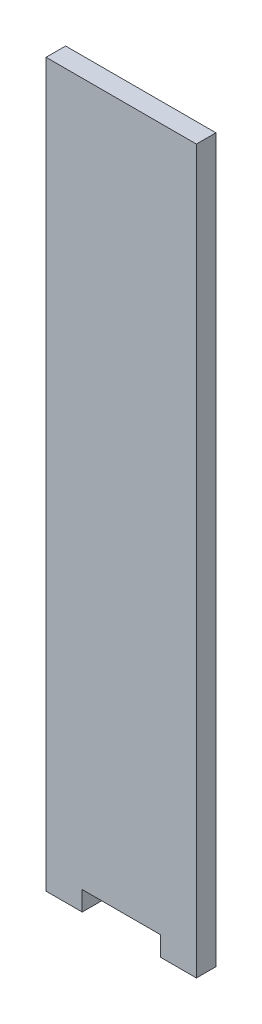
ISO-10303-21;
HEADER;
FILE_DESCRIPTION(('STEP AP214'),'2;1');
FILE_NAME('part.step','',(''),(''),'','','');
FILE_SCHEMA(('AUTOMOTIVE_DESIGN { 1 0 10303 214 1 1 1 1 }'));
ENDSEC;
DATA;
#1=APPLICATION_CONTEXT('core data for automotive mechanical design processes');
#2=APPLICATION_PROTOCOL_DEFINITION('international standard','automotive_design',2000,#1);
#3=PRODUCT_CONTEXT('',#1,'mechanical');
#4=PRODUCT('Part','Part','',(#3));
#5=PRODUCT_RELATED_PRODUCT_CATEGORY('part','',(#4));
#6=PRODUCT_DEFINITION_FORMATION('','',#4);
#7=PRODUCT_DEFINITION_CONTEXT('part definition',#1,'design');
#8=PRODUCT_DEFINITION('design','',#6,#7);
#9=PRODUCT_DEFINITION_SHAPE('','',#8);
#10=(LENGTH_UNIT() NAMED_UNIT(*) SI_UNIT(.MILLI.,.METRE.));
#11=(NAMED_UNIT(*) PLANE_ANGLE_UNIT() SI_UNIT($,.RADIAN.));
#12=(NAMED_UNIT(*) SI_UNIT($,.STERADIAN.) SOLID_ANGLE_UNIT());
#13=UNCERTAINTY_MEASURE_WITH_UNIT(LENGTH_MEASURE(1.E-05),#10,'distance_accuracy_value','');
#14=(GEOMETRIC_REPRESENTATION_CONTEXT(3) GLOBAL_UNCERTAINTY_ASSIGNED_CONTEXT((#13)) GLOBAL_UNIT_ASSIGNED_CONTEXT((#10,
#11,#12)) REPRESENTATION_CONTEXT('',''));
#15=CARTESIAN_POINT('',(0.,0.,0.));
#16=DIRECTION('',(0.,0.,1.));
#17=DIRECTION('',(1.,0.,0.));
#18=AXIS2_PLACEMENT_3D('',#15,#16,#17);
#19=CARTESIAN_POINT('',(-19.25,-5.,5.));
#20=DIRECTION('',(1.,0.,0.));
#21=DIRECTION('',(0.,1.,0.));
#22=AXIS2_PLACEMENT_3D('',#19,#20,#21);
#23=PLANE('',#22);
#24=DIRECTION('',(0.,-1.,0.));
#25=VECTOR('',#24,1.);
#26=CARTESIAN_POINT('',(-19.25,-5.,0.));
#27=LINE('',#26,#25);
#28=CARTESIAN_POINT('',(-19.25,180.,0.));
#29=VERTEX_POINT('',#28);
#30=CARTESIAN_POINT('',(-19.25,-5.,0.));
#31=VERTEX_POINT('',#30);
#32=EDGE_CURVE('E84',#29,#31,#27,.T.);
#33=ORIENTED_EDGE('',*,*,#32,.T.);
#34=DIRECTION('',(0.,0.,-1.));
#35=VECTOR('',#34,1.);
#36=CARTESIAN_POINT('',(-19.25,-5.,5.));
#37=LINE('',#36,#35);
#38=CARTESIAN_POINT('',(-19.25,-5.,5.));
#39=VERTEX_POINT('',#38);
#40=EDGE_CURVE('E11',#39,#31,#37,.T.);
#41=ORIENTED_EDGE('',*,*,#40,.F.);
#42=DIRECTION('',(0.,-1.,0.));
#43=VECTOR('',#42,1.);
#44=CARTESIAN_POINT('',(-19.25,180.,5.));
#45=LINE('',#44,#43);
#46=CARTESIAN_POINT('',(-19.25,180.,5.));
#47=VERTEX_POINT('',#46);
#48=EDGE_CURVE('E90',#47,#39,#45,.T.);
#49=ORIENTED_EDGE('',*,*,#48,.F.);
#50=DIRECTION('',(0.,0.,-1.));
#51=VECTOR('',#50,1.);
#52=CARTESIAN_POINT('',(-19.25,180.,5.));
#53=LINE('',#52,#51);
#54=EDGE_CURVE('E125',#47,#29,#53,.T.);
#55=ORIENTED_EDGE('',*,*,#54,.T.);
#56=EDGE_LOOP('',(#33,#41,#49,#55));
#57=FACE_BOUND('',#56,.T.);
#58=ADVANCED_FACE('F33',(#57),#23,.F.);
#59=CARTESIAN_POINT('',(-19.25,-5.,5.));
#60=DIRECTION('',(0.,1.,0.));
#61=DIRECTION('',(0.,0.,1.));
#62=AXIS2_PLACEMENT_3D('',#59,#60,#61);
#63=PLANE('',#62);
#64=DIRECTION('',(1.,0.,0.));
#65=VECTOR('',#64,1.);
#66=CARTESIAN_POINT('',(-19.25,-5.,0.));
#67=LINE('',#66,#65);
#68=CARTESIAN_POINT('',(-10.,-5.,0.));
#69=VERTEX_POINT('',#68);
#70=EDGE_CURVE('E130',#31,#69,#67,.T.);
#71=ORIENTED_EDGE('',*,*,#70,.T.);
#72=DIRECTION('',(0.,0.,-1.));
#73=VECTOR('',#72,1.);
#74=CARTESIAN_POINT('',(-10.,-5.,5.));
#75=LINE('',#74,#73);
#76=CARTESIAN_POINT('',(-10.,-5.,5.));
#77=VERTEX_POINT('',#76);
#78=EDGE_CURVE('E41',#77,#69,#75,.T.);
#79=ORIENTED_EDGE('',*,*,#78,.F.);
#80=DIRECTION('',(1.,0.,0.));
#81=VECTOR('',#80,1.);
#82=CARTESIAN_POINT('',(-19.25,-5.,5.));
#83=LINE('',#82,#81);
#84=EDGE_CURVE('E174',#39,#77,#83,.T.);
#85=ORIENTED_EDGE('',*,*,#84,.F.);
#86=ORIENTED_EDGE('',*,*,#40,.T.);
#87=EDGE_LOOP('',(#71,#79,#85,#86));
#88=FACE_BOUND('',#87,.T.);
#89=ADVANCED_FACE('F176',(#88),#63,.F.);
#90=CARTESIAN_POINT('',(-10.,-5.,5.));
#91=DIRECTION('',(-1.,0.,0.));
#92=DIRECTION('',(0.,0.,1.));
#93=AXIS2_PLACEMENT_3D('',#90,#91,#92);
#94=PLANE('',#93);
#95=DIRECTION('',(0.,1.,0.));
#96=VECTOR('',#95,1.);
#97=CARTESIAN_POINT('',(-10.,-5.,0.));
#98=LINE('',#97,#96);
#99=CARTESIAN_POINT('',(-10.,0.,0.));
#100=VERTEX_POINT('',#99);
#101=EDGE_CURVE('E132',#69,#100,#98,.T.);
#102=ORIENTED_EDGE('',*,*,#101,.T.);
#103=DIRECTION('',(0.,0.,-1.));
#104=VECTOR('',#103,1.);
#105=CARTESIAN_POINT('',(-10.,0.,5.));
#106=LINE('',#105,#104);
#107=CARTESIAN_POINT('',(-10.,0.,5.));
#108=VERTEX_POINT('',#107);
#109=EDGE_CURVE('E149',#108,#100,#106,.T.);
#110=ORIENTED_EDGE('',*,*,#109,.F.);
#111=DIRECTION('',(0.,1.,0.));
#112=VECTOR('',#111,1.);
#113=CARTESIAN_POINT('',(-10.,-5.,5.));
#114=LINE('',#113,#112);
#115=EDGE_CURVE('E158',#77,#108,#114,.T.);
#116=ORIENTED_EDGE('',*,*,#115,.F.);
#117=ORIENTED_EDGE('',*,*,#78,.T.);
#118=EDGE_LOOP('',(#102,#110,#116,#117));
#119=FACE_BOUND('',#118,.T.);
#120=ADVANCED_FACE('F156',(#119),#94,.F.);
#121=CARTESIAN_POINT('',(-10.,0.,5.));
#122=DIRECTION('',(0.,1.,0.));
#123=DIRECTION('',(0.,0.,1.));
#124=AXIS2_PLACEMENT_3D('',#121,#122,#123);
#125=PLANE('',#124);
#126=DIRECTION('',(1.,0.,0.));
#127=VECTOR('',#126,1.);
#128=CARTESIAN_POINT('',(-10.,0.,0.));
#129=LINE('',#128,#127);
#130=CARTESIAN_POINT('',(10.,0.,0.));
#131=VERTEX_POINT('',#130);
#132=EDGE_CURVE('E134',#100,#131,#129,.T.);
#133=ORIENTED_EDGE('',*,*,#132,.T.);
#134=DIRECTION('',(0.,0.,-1.));
#135=VECTOR('',#134,1.);
#136=CARTESIAN_POINT('',(10.,0.,5.));
#137=LINE('',#136,#135);
#138=CARTESIAN_POINT('',(10.,0.,5.));
#139=VERTEX_POINT('',#138);
#140=EDGE_CURVE('E146',#139,#131,#137,.T.);
#141=ORIENTED_EDGE('',*,*,#140,.F.);
#142=DIRECTION('',(1.,0.,0.));
#143=VECTOR('',#142,1.);
#144=CARTESIAN_POINT('',(-10.,0.,5.));
#145=LINE('',#144,#143);
#146=EDGE_CURVE('E170',#108,#139,#145,.T.);
#147=ORIENTED_EDGE('',*,*,#146,.F.);
#148=ORIENTED_EDGE('',*,*,#109,.T.);
#149=EDGE_LOOP('',(#133,#141,#147,#148));
#150=FACE_BOUND('',#149,.T.);
#151=ADVANCED_FACE('F166',(#150),#125,.F.);
#152=CARTESIAN_POINT('',(10.,-5.,5.));
#153=DIRECTION('',(1.,0.,0.));
#154=DIRECTION('',(0.,0.,-1.));
#155=AXIS2_PLACEMENT_3D('',#152,#153,#154);
#156=PLANE('',#155);
#157=DIRECTION('',(0.,-1.,0.));
#158=VECTOR('',#157,1.);
#159=CARTESIAN_POINT('',(10.,-5.,0.));
#160=LINE('',#159,#158);
#161=CARTESIAN_POINT('',(10.,-5.,0.));
#162=VERTEX_POINT('',#161);
#163=EDGE_CURVE('E136',#131,#162,#160,.T.);
#164=ORIENTED_EDGE('',*,*,#163,.T.);
#165=DIRECTION('',(0.,0.,-1.));
#166=VECTOR('',#165,1.);
#167=CARTESIAN_POINT('',(10.,-5.,5.));
#168=LINE('',#167,#166);
#169=CARTESIAN_POINT('',(10.,-5.,5.));
#170=VERTEX_POINT('',#169);
#171=EDGE_CURVE('E120',#170,#162,#168,.T.);
#172=ORIENTED_EDGE('',*,*,#171,.F.);
#173=DIRECTION('',(0.,-1.,0.));
#174=VECTOR('',#173,1.);
#175=CARTESIAN_POINT('',(10.,-5.,5.));
#176=LINE('',#175,#174);
#177=EDGE_CURVE('E110',#139,#170,#176,.T.);
#178=ORIENTED_EDGE('',*,*,#177,.F.);
#179=ORIENTED_EDGE('',*,*,#140,.T.);
#180=EDGE_LOOP('',(#164,#172,#178,#179));
#181=FACE_BOUND('',#180,.T.);
#182=ADVANCED_FACE('F169',(#181),#156,.F.);
#183=CARTESIAN_POINT('',(19.25,-5.,5.));
#184=DIRECTION('',(0.,1.,0.));
#185=DIRECTION('',(0.,0.,1.));
#186=AXIS2_PLACEMENT_3D('',#183,#184,#185);
#187=PLANE('',#186);
#188=DIRECTION('',(1.,0.,0.));
#189=VECTOR('',#188,1.);
#190=CARTESIAN_POINT('',(19.25,-5.,0.));
#191=LINE('',#190,#189);
#192=CARTESIAN_POINT('',(19.25,-5.,0.));
#193=VERTEX_POINT('',#192);
#194=EDGE_CURVE('E119',#162,#193,#191,.T.);
#195=ORIENTED_EDGE('',*,*,#194,.T.);
#196=DIRECTION('',(0.,0.,-1.));
#197=VECTOR('',#196,1.);
#198=CARTESIAN_POINT('',(19.25,-5.,5.));
#199=LINE('',#198,#197);
#200=CARTESIAN_POINT('',(19.25,-5.,5.));
#201=VERTEX_POINT('',#200);
#202=EDGE_CURVE('E116',#201,#193,#199,.T.);
#203=ORIENTED_EDGE('',*,*,#202,.F.);
#204=DIRECTION('',(1.,0.,0.));
#205=VECTOR('',#204,1.);
#206=CARTESIAN_POINT('',(19.25,-5.,5.));
#207=LINE('',#206,#205);
#208=EDGE_CURVE('E104',#170,#201,#207,.T.);
#209=ORIENTED_EDGE('',*,*,#208,.F.);
#210=ORIENTED_EDGE('',*,*,#171,.T.);
#211=EDGE_LOOP('',(#195,#203,#209,#210));
#212=FACE_BOUND('',#211,.T.);
#213=ADVANCED_FACE('F117',(#212),#187,.F.);
#214=CARTESIAN_POINT('',(19.25,180.,5.));
#215=DIRECTION('',(-1.,0.,0.));
#216=DIRECTION('',(0.,-1.,0.));
#217=AXIS2_PLACEMENT_3D('',#214,#215,#216);
#218=PLANE('',#217);
#219=DIRECTION('',(0.,1.,0.));
#220=VECTOR('',#219,1.);
#221=CARTESIAN_POINT('',(19.25,180.,0.));
#222=LINE('',#221,#220);
#223=CARTESIAN_POINT('',(19.25,180.,0.));
#224=VERTEX_POINT('',#223);
#225=EDGE_CURVE('E77',#193,#224,#222,.T.);
#226=ORIENTED_EDGE('',*,*,#225,.T.);
#227=DIRECTION('',(0.,0.,-1.));
#228=VECTOR('',#227,1.);
#229=CARTESIAN_POINT('',(19.25,180.,5.));
#230=LINE('',#229,#228);
#231=CARTESIAN_POINT('',(19.25,180.,5.));
#232=VERTEX_POINT('',#231);
#233=EDGE_CURVE('E121',#232,#224,#230,.T.);
#234=ORIENTED_EDGE('',*,*,#233,.F.);
#235=DIRECTION('',(0.,1.,0.));
#236=VECTOR('',#235,1.);
#237=CARTESIAN_POINT('',(19.25,0.,5.));
#238=LINE('',#237,#236);
#239=EDGE_CURVE('E108',#201,#232,#238,.T.);
#240=ORIENTED_EDGE('',*,*,#239,.F.);
#241=ORIENTED_EDGE('',*,*,#202,.T.);
#242=EDGE_LOOP('',(#226,#234,#240,#241));
#243=FACE_BOUND('',#242,.T.);
#244=ADVANCED_FACE('F123',(#243),#218,.F.);
#245=CARTESIAN_POINT('',(-19.25,180.,5.));
#246=DIRECTION('',(0.,-1.,0.));
#247=DIRECTION('',(0.,0.,-1.));
#248=AXIS2_PLACEMENT_3D('',#245,#246,#247);
#249=PLANE('',#248);
#250=DIRECTION('',(-1.,0.,0.));
#251=VECTOR('',#250,1.);
#252=CARTESIAN_POINT('',(-19.25,180.,0.));
#253=LINE('',#252,#251);
#254=EDGE_CURVE('E140',#224,#29,#253,.T.);
#255=ORIENTED_EDGE('',*,*,#254,.T.);
#256=ORIENTED_EDGE('',*,*,#54,.F.);
#257=DIRECTION('',(-1.,0.,0.));
#258=VECTOR('',#257,1.);
#259=CARTESIAN_POINT('',(-19.25,180.,5.));
#260=LINE('',#259,#258);
#261=EDGE_CURVE('E49',#232,#47,#260,.T.);
#262=ORIENTED_EDGE('',*,*,#261,.F.);
#263=ORIENTED_EDGE('',*,*,#233,.T.);
#264=EDGE_LOOP('',(#255,#256,#262,#263));
#265=FACE_BOUND('',#264,.T.);
#266=ADVANCED_FACE('F179',(#265),#249,.F.);
#267=CARTESIAN_POINT('',(0.,0.,5.));
#268=DIRECTION('',(0.,0.,1.));
#269=DIRECTION('',(1.,0.,0.));
#270=AXIS2_PLACEMENT_3D('',#267,#268,#269);
#271=PLANE('',#270);
#272=ORIENTED_EDGE('',*,*,#48,.T.);
#273=ORIENTED_EDGE('',*,*,#84,.T.);
#274=ORIENTED_EDGE('',*,*,#115,.T.);
#275=ORIENTED_EDGE('',*,*,#146,.T.);
#276=ORIENTED_EDGE('',*,*,#177,.T.);
#277=ORIENTED_EDGE('',*,*,#208,.T.);
#278=ORIENTED_EDGE('',*,*,#239,.T.);
#279=ORIENTED_EDGE('',*,*,#261,.T.);
#280=EDGE_LOOP('',(#272,#273,#274,#275,#276,#277,#278,#279));
#281=FACE_BOUND('',#280,.T.);
#282=ADVANCED_FACE('F106',(#281),#271,.T.);
#283=CARTESIAN_POINT('',(0.,0.,0.));
#284=DIRECTION('',(0.,0.,1.));
#285=DIRECTION('',(1.,0.,0.));
#286=AXIS2_PLACEMENT_3D('',#283,#284,#285);
#287=PLANE('',#286);
#288=ORIENTED_EDGE('',*,*,#32,.F.);
#289=ORIENTED_EDGE('',*,*,#254,.F.);
#290=ORIENTED_EDGE('',*,*,#225,.F.);
#291=ORIENTED_EDGE('',*,*,#194,.F.);
#292=ORIENTED_EDGE('',*,*,#163,.F.);
#293=ORIENTED_EDGE('',*,*,#132,.F.);
#294=ORIENTED_EDGE('',*,*,#101,.F.);
#295=ORIENTED_EDGE('',*,*,#70,.F.);
#296=EDGE_LOOP('',(#288,#289,#290,#291,#292,#293,#294,#295));
#297=FACE_BOUND('',#296,.T.);
#298=ADVANCED_FACE('F162',(#297),#287,.F.);
#299=CLOSED_SHELL('',(#58,#89,#120,#151,#182,#213,#244,#266,#282,#298));
#300=MANIFOLD_SOLID_BREP('B2',#299);
#301=ADVANCED_BREP_SHAPE_REPRESENTATION('',(#18,#300),#14);
#302=SHAPE_DEFINITION_REPRESENTATION(#9,#301);
ENDSEC;
END-ISO-10303-21;
